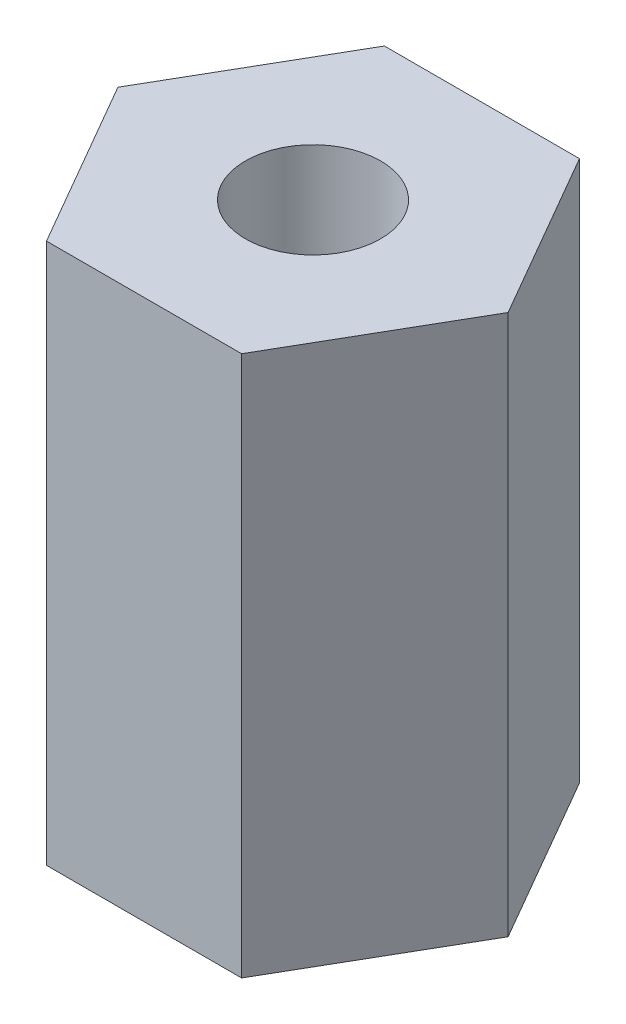
ISO-10303-21;
HEADER;
FILE_DESCRIPTION(('STEP AP214'),'2;1');
FILE_NAME('part.step','',(''),(''),'','','');
FILE_SCHEMA(('AUTOMOTIVE_DESIGN { 1 0 10303 214 1 1 1 1 }'));
ENDSEC;
DATA;
#1=APPLICATION_CONTEXT('core data for automotive mechanical design processes');
#2=APPLICATION_PROTOCOL_DEFINITION('international standard','automotive_design',2000,#1);
#3=PRODUCT_CONTEXT('',#1,'mechanical');
#4=PRODUCT('Part','Part','',(#3));
#5=PRODUCT_RELATED_PRODUCT_CATEGORY('part','',(#4));
#6=PRODUCT_DEFINITION_FORMATION('','',#4);
#7=PRODUCT_DEFINITION_CONTEXT('part definition',#1,'design');
#8=PRODUCT_DEFINITION('design','',#6,#7);
#9=PRODUCT_DEFINITION_SHAPE('','',#8);
#10=(LENGTH_UNIT() NAMED_UNIT(*) SI_UNIT(.MILLI.,.METRE.));
#11=(NAMED_UNIT(*) PLANE_ANGLE_UNIT() SI_UNIT($,.RADIAN.));
#12=(NAMED_UNIT(*) SI_UNIT($,.STERADIAN.) SOLID_ANGLE_UNIT());
#13=UNCERTAINTY_MEASURE_WITH_UNIT(LENGTH_MEASURE(1.E-05),#10,'distance_accuracy_value','');
#14=(GEOMETRIC_REPRESENTATION_CONTEXT(3) GLOBAL_UNCERTAINTY_ASSIGNED_CONTEXT((#13)) GLOBAL_UNIT_ASSIGNED_CONTEXT((#10,
#11,#12)) REPRESENTATION_CONTEXT('',''));
#15=CARTESIAN_POINT('',(0.,0.,0.));
#16=DIRECTION('',(0.,0.,1.));
#17=DIRECTION('',(1.,0.,0.));
#18=AXIS2_PLACEMENT_3D('',#15,#16,#17);
#19=CARTESIAN_POINT('',(1.443375673,8.,2.5));
#20=DIRECTION('',(-0.866025403838329,0.,-0.499999999906659));
#21=DIRECTION('',(-0.499999999906659,0.,0.866025403838329));
#22=AXIS2_PLACEMENT_3D('',#19,#20,#21);
#23=PLANE('',#22);
#24=DIRECTION('',(0.500000000006738,0.,-0.866025403780548));
#25=VECTOR('',#24,1.);
#26=CARTESIAN_POINT('',(1.443375673,8.,2.5));
#27=LINE('',#26,#25);
#28=CARTESIAN_POINT('',(1.443375673,8.,2.5));
#29=VERTEX_POINT('',#28);
#30=CARTESIAN_POINT('',(2.88675134585555,8.,-8.33995045868235E-11));
#31=VERTEX_POINT('',#30);
#32=EDGE_CURVE('E65',#29,#31,#27,.T.);
#33=ORIENTED_EDGE('',*,*,#32,.F.);
#34=DIRECTION('',(0.,1.,0.));
#35=VECTOR('',#34,1.);
#36=CARTESIAN_POINT('',(1.443375673,8.,2.5));
#37=LINE('',#36,#35);
#38=CARTESIAN_POINT('',(1.443375673,0.,2.5));
#39=VERTEX_POINT('',#38);
#40=EDGE_CURVE('E97',#39,#29,#37,.T.);
#41=ORIENTED_EDGE('',*,*,#40,.F.);
#42=DIRECTION('',(-0.500000000006738,0.,0.866025403780548));
#43=VECTOR('',#42,1.);
#44=CARTESIAN_POINT('',(2.886751346,0.,0.));
#45=LINE('',#44,#43);
#46=CARTESIAN_POINT('',(2.88675134585555,0.,-8.33993789826903E-11));
#47=VERTEX_POINT('',#46);
#48=EDGE_CURVE('E71',#47,#39,#45,.T.);
#49=ORIENTED_EDGE('',*,*,#48,.F.);
#50=DIRECTION('',(0.,1.,0.));
#51=VECTOR('',#50,1.);
#52=CARTESIAN_POINT('',(2.886751346,8.,0.));
#53=LINE('',#52,#51);
#54=EDGE_CURVE('E68',#31,#47,#53,.F.);
#55=ORIENTED_EDGE('',*,*,#54,.F.);
#56=EDGE_LOOP('',(#33,#41,#49,#55));
#57=FACE_BOUND('',#56,.T.);
#58=ADVANCED_FACE('F17',(#57),#23,.F.);
#59=CARTESIAN_POINT('',(-1.443375673,8.,2.5));
#60=DIRECTION('',(0.,0.,-1.));
#61=DIRECTION('',(-1.,0.,0.));
#62=AXIS2_PLACEMENT_3D('',#59,#60,#61);
#63=PLANE('',#62);
#64=DIRECTION('',(1.,0.,0.));
#65=VECTOR('',#64,1.);
#66=CARTESIAN_POINT('',(0.,8.,2.5));
#67=LINE('',#66,#65);
#68=CARTESIAN_POINT('',(-1.44337567314445,8.,2.5000000000834));
#69=VERTEX_POINT('',#68);
#70=EDGE_CURVE('E86',#69,#29,#67,.T.);
#71=ORIENTED_EDGE('',*,*,#70,.F.);
#72=DIRECTION('',(0.,1.,0.));
#73=VECTOR('',#72,1.);
#74=CARTESIAN_POINT('',(-1.4433756732889,8.,2.5000000001668));
#75=LINE('',#74,#73);
#76=CARTESIAN_POINT('',(-1.44337567307223,0.,2.5000000000417));
#77=VERTEX_POINT('',#76);
#78=EDGE_CURVE('E95',#77,#69,#75,.T.);
#79=ORIENTED_EDGE('',*,*,#78,.F.);
#80=DIRECTION('',(1.,0.,0.));
#81=VECTOR('',#80,1.);
#82=CARTESIAN_POINT('',(0.,0.,2.5));
#83=LINE('',#82,#81);
#84=EDGE_CURVE('E102',#39,#77,#83,.F.);
#85=ORIENTED_EDGE('',*,*,#84,.F.);
#86=ORIENTED_EDGE('',*,*,#40,.T.);
#87=EDGE_LOOP('',(#71,#79,#85,#86));
#88=FACE_BOUND('',#87,.T.);
#89=ADVANCED_FACE('F100',(#88),#63,.F.);
#90=CARTESIAN_POINT('',(-2.886751346,8.,0.));
#91=DIRECTION('',(0.866025403838329,0.,-0.499999999906659));
#92=DIRECTION('',(-0.499999999906659,0.,-0.866025403838329));
#93=AXIS2_PLACEMENT_3D('',#90,#91,#92);
#94=PLANE('',#93);
#95=DIRECTION('',(0.500000000006738,0.,0.866025403780548));
#96=VECTOR('',#95,1.);
#97=CARTESIAN_POINT('',(-2.886751346,8.,0.));
#98=LINE('',#97,#96);
#99=CARTESIAN_POINT('',(-2.88675134585555,8.,8.33995045868235E-11));
#100=VERTEX_POINT('',#99);
#101=EDGE_CURVE('E112',#100,#69,#98,.T.);
#102=ORIENTED_EDGE('',*,*,#101,.F.);
#103=DIRECTION('',(0.,1.,0.));
#104=VECTOR('',#103,1.);
#105=CARTESIAN_POINT('',(-2.8867513457111,8.,1.66798866385598E-10));
#106=LINE('',#105,#104);
#107=CARTESIAN_POINT('',(-2.88675134592777,0.,4.16996623862909E-11));
#108=VERTEX_POINT('',#107);
#109=EDGE_CURVE('E93',#108,#100,#106,.T.);
#110=ORIENTED_EDGE('',*,*,#109,.F.);
#111=DIRECTION('',(-0.500000000006738,0.,-0.866025403780548));
#112=VECTOR('',#111,1.);
#113=CARTESIAN_POINT('',(-1.443375673,0.,2.5));
#114=LINE('',#113,#112);
#115=EDGE_CURVE('E106',#77,#108,#114,.T.);
#116=ORIENTED_EDGE('',*,*,#115,.F.);
#117=ORIENTED_EDGE('',*,*,#78,.T.);
#118=EDGE_LOOP('',(#102,#110,#116,#117));
#119=FACE_BOUND('',#118,.T.);
#120=ADVANCED_FACE('F129',(#119),#94,.F.);
#121=CARTESIAN_POINT('',(-1.443375673,8.,-2.5));
#122=DIRECTION('',(0.866025403838329,0.,0.499999999906659));
#123=DIRECTION('',(0.499999999906659,0.,-0.866025403838329));
#124=AXIS2_PLACEMENT_3D('',#121,#122,#123);
#125=PLANE('',#124);
#126=DIRECTION('',(-0.500000000006738,0.,0.866025403780548));
#127=VECTOR('',#126,1.);
#128=CARTESIAN_POINT('',(-1.443375673,8.,-2.5));
#129=LINE('',#128,#127);
#130=CARTESIAN_POINT('',(-1.443375673,8.,-2.5));
#131=VERTEX_POINT('',#130);
#132=EDGE_CURVE('E117',#131,#100,#129,.T.);
#133=ORIENTED_EDGE('',*,*,#132,.F.);
#134=DIRECTION('',(0.,1.,0.));
#135=VECTOR('',#134,1.);
#136=CARTESIAN_POINT('',(-1.443375673,8.,-2.5));
#137=LINE('',#136,#135);
#138=CARTESIAN_POINT('',(-1.443375673,0.,-2.5));
#139=VERTEX_POINT('',#138);
#140=EDGE_CURVE('E91',#139,#131,#137,.T.);
#141=ORIENTED_EDGE('',*,*,#140,.F.);
#142=DIRECTION('',(0.500000000006738,0.,-0.866025403780548));
#143=VECTOR('',#142,1.);
#144=CARTESIAN_POINT('',(-2.886751346,0.,0.));
#145=LINE('',#144,#143);
#146=EDGE_CURVE('E127',#108,#139,#145,.T.);
#147=ORIENTED_EDGE('',*,*,#146,.F.);
#148=ORIENTED_EDGE('',*,*,#109,.T.);
#149=EDGE_LOOP('',(#133,#141,#147,#148));
#150=FACE_BOUND('',#149,.T.);
#151=ADVANCED_FACE('F125',(#150),#125,.F.);
#152=CARTESIAN_POINT('',(1.443375673,8.,-2.5));
#153=DIRECTION('',(0.,0.,1.));
#154=DIRECTION('',(1.,0.,0.));
#155=AXIS2_PLACEMENT_3D('',#152,#153,#154);
#156=PLANE('',#155);
#157=DIRECTION('',(1.,0.,0.));
#158=VECTOR('',#157,1.);
#159=CARTESIAN_POINT('',(0.,8.,-2.5));
#160=LINE('',#159,#158);
#161=CARTESIAN_POINT('',(1.44337567314445,8.,-2.5000000000834));
#162=VERTEX_POINT('',#161);
#163=EDGE_CURVE('E80',#162,#131,#160,.F.);
#164=ORIENTED_EDGE('',*,*,#163,.F.);
#165=DIRECTION('',(0.,1.,0.));
#166=VECTOR('',#165,1.);
#167=CARTESIAN_POINT('',(1.4433756732889,8.,-2.5000000001668));
#168=LINE('',#167,#166);
#169=CARTESIAN_POINT('',(1.44337567307223,0.,-2.5000000000417));
#170=VERTEX_POINT('',#169);
#171=EDGE_CURVE('E33',#170,#162,#168,.T.);
#172=ORIENTED_EDGE('',*,*,#171,.F.);
#173=DIRECTION('',(1.,0.,0.));
#174=VECTOR('',#173,1.);
#175=CARTESIAN_POINT('',(0.,0.,-2.5));
#176=LINE('',#175,#174);
#177=EDGE_CURVE('E121',#139,#170,#176,.T.);
#178=ORIENTED_EDGE('',*,*,#177,.F.);
#179=ORIENTED_EDGE('',*,*,#140,.T.);
#180=EDGE_LOOP('',(#164,#172,#178,#179));
#181=FACE_BOUND('',#180,.T.);
#182=ADVANCED_FACE('F120',(#181),#156,.F.);
#183=CARTESIAN_POINT('',(2.886751346,8.,0.));
#184=DIRECTION('',(-0.866025403838329,0.,0.499999999906659));
#185=DIRECTION('',(0.499999999906659,0.,0.866025403838329));
#186=AXIS2_PLACEMENT_3D('',#183,#184,#185);
#187=PLANE('',#186);
#188=DIRECTION('',(-0.500000000006738,0.,-0.866025403780548));
#189=VECTOR('',#188,1.);
#190=CARTESIAN_POINT('',(2.886751346,8.,0.));
#191=LINE('',#190,#189);
#192=EDGE_CURVE('E76',#31,#162,#191,.T.);
#193=ORIENTED_EDGE('',*,*,#192,.F.);
#194=ORIENTED_EDGE('',*,*,#54,.T.);
#195=DIRECTION('',(0.500000000006738,0.,0.866025403780548));
#196=VECTOR('',#195,1.);
#197=CARTESIAN_POINT('',(1.443375673,0.,-2.5));
#198=LINE('',#197,#196);
#199=EDGE_CURVE('E110',#170,#47,#198,.T.);
#200=ORIENTED_EDGE('',*,*,#199,.F.);
#201=ORIENTED_EDGE('',*,*,#171,.T.);
#202=EDGE_LOOP('',(#193,#194,#200,#201));
#203=FACE_BOUND('',#202,.T.);
#204=ADVANCED_FACE('F77',(#203),#187,.F.);
#205=CARTESIAN_POINT('',(0.,8.,0.));
#206=DIRECTION('',(0.,1.,0.));
#207=DIRECTION('',(0.,0.,1.));
#208=AXIS2_PLACEMENT_3D('',#205,#206,#207);
#209=PLANE('',#208);
#210=CARTESIAN_POINT('',(0.,8.,0.));
#211=DIRECTION('',(0.,-1.,0.));
#212=DIRECTION('',(0.,0.,-1.));
#213=AXIS2_PLACEMENT_3D('',#210,#211,#212);
#214=CIRCLE('',#213,1.);
#215=CARTESIAN_POINT('',(0.,8.,-1.));
#216=VERTEX_POINT('',#215);
#217=EDGE_CURVE('E20',#216,#216,#214,.F.);
#218=ORIENTED_EDGE('',*,*,#217,.F.);
#219=EDGE_LOOP('',(#218));
#220=FACE_BOUND('',#219,.T.);
#221=ORIENTED_EDGE('',*,*,#101,.T.);
#222=ORIENTED_EDGE('',*,*,#70,.T.);
#223=ORIENTED_EDGE('',*,*,#32,.T.);
#224=ORIENTED_EDGE('',*,*,#192,.T.);
#225=ORIENTED_EDGE('',*,*,#163,.T.);
#226=ORIENTED_EDGE('',*,*,#132,.T.);
#227=EDGE_LOOP('',(#221,#222,#223,#224,#225,#226));
#228=FACE_BOUND('',#227,.T.);
#229=ADVANCED_FACE('F84',(#220,#228),#209,.T.);
#230=CARTESIAN_POINT('',(0.,0.,0.));
#231=DIRECTION('',(0.,1.,0.));
#232=DIRECTION('',(0.,0.,1.));
#233=AXIS2_PLACEMENT_3D('',#230,#231,#232);
#234=PLANE('',#233);
#235=CARTESIAN_POINT('',(0.,0.,0.));
#236=DIRECTION('',(0.,-1.,0.));
#237=DIRECTION('',(0.,0.,-1.));
#238=AXIS2_PLACEMENT_3D('',#235,#236,#237);
#239=CIRCLE('',#238,1.);
#240=CARTESIAN_POINT('',(0.,0.,-1.));
#241=VERTEX_POINT('',#240);
#242=EDGE_CURVE('E11',#241,#241,#239,.T.);
#243=ORIENTED_EDGE('',*,*,#242,.F.);
#244=EDGE_LOOP('',(#243));
#245=FACE_BOUND('',#244,.T.);
#246=ORIENTED_EDGE('',*,*,#177,.T.);
#247=ORIENTED_EDGE('',*,*,#199,.T.);
#248=ORIENTED_EDGE('',*,*,#48,.T.);
#249=ORIENTED_EDGE('',*,*,#84,.T.);
#250=ORIENTED_EDGE('',*,*,#115,.T.);
#251=ORIENTED_EDGE('',*,*,#146,.T.);
#252=EDGE_LOOP('',(#246,#247,#248,#249,#250,#251));
#253=FACE_BOUND('',#252,.T.);
#254=ADVANCED_FACE('F109',(#245,#253),#234,.F.);
#255=CARTESIAN_POINT('',(0.,8.,0.));
#256=DIRECTION('',(0.,-1.,0.));
#257=DIRECTION('',(0.,0.,-1.));
#258=AXIS2_PLACEMENT_3D('',#255,#256,#257);
#259=CYLINDRICAL_SURFACE('',#258,1.);
#260=ORIENTED_EDGE('',*,*,#242,.T.);
#261=EDGE_LOOP('',(#260));
#262=FACE_BOUND('',#261,.T.);
#263=ORIENTED_EDGE('',*,*,#217,.T.);
#264=EDGE_LOOP('',(#263));
#265=FACE_BOUND('',#264,.T.);
#266=ADVANCED_FACE('F136',(#262,#265),#259,.F.);
#267=CLOSED_SHELL('',(#58,#89,#120,#151,#182,#204,#229,#254,#266));
#268=MANIFOLD_SOLID_BREP('B1',#267);
#269=ADVANCED_BREP_SHAPE_REPRESENTATION('',(#18,#268),#14);
#270=SHAPE_DEFINITION_REPRESENTATION(#9,#269);
ENDSEC;
END-ISO-10303-21;
